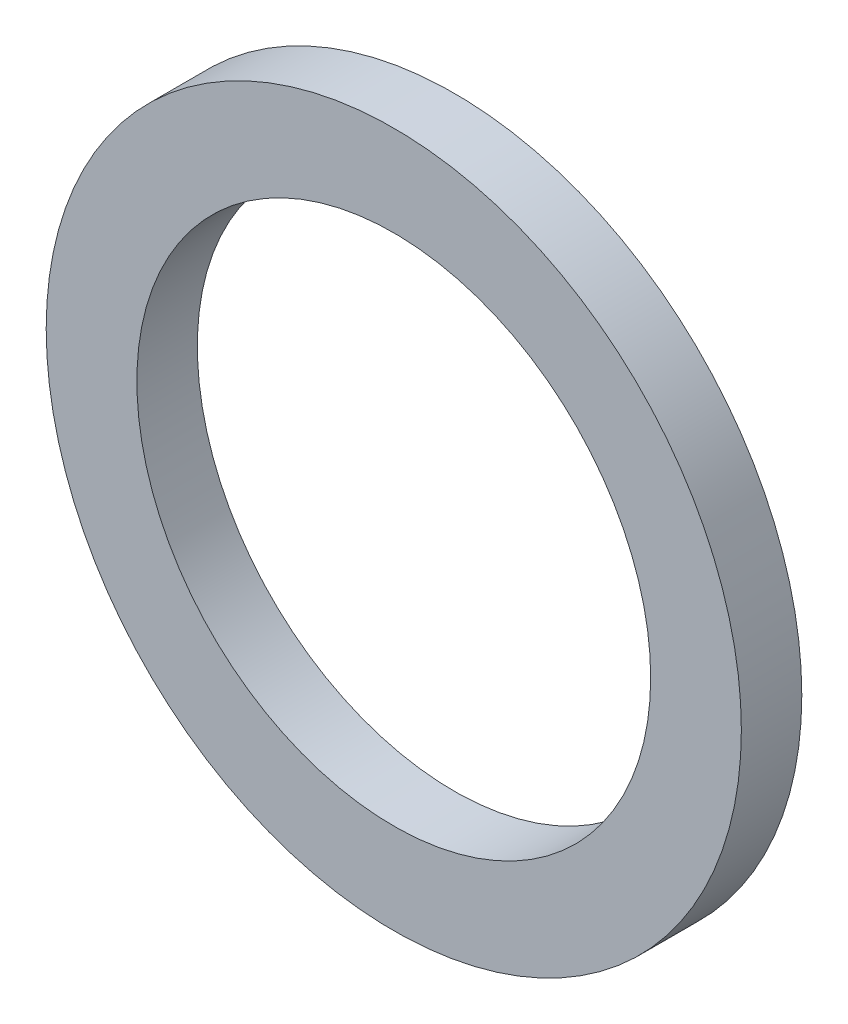
ISO-10303-21;
HEADER;
FILE_DESCRIPTION(('STEP AP214'),'2;1');
FILE_NAME('part.step','',(''),(''),'','','');
FILE_SCHEMA(('AUTOMOTIVE_DESIGN { 1 0 10303 214 1 1 1 1 }'));
ENDSEC;
DATA;
#1=APPLICATION_CONTEXT('core data for automotive mechanical design processes');
#2=APPLICATION_PROTOCOL_DEFINITION('international standard','automotive_design',2000,#1);
#3=PRODUCT_CONTEXT('',#1,'mechanical');
#4=PRODUCT('Part','Part','',(#3));
#5=PRODUCT_RELATED_PRODUCT_CATEGORY('part','',(#4));
#6=PRODUCT_DEFINITION_FORMATION('','',#4);
#7=PRODUCT_DEFINITION_CONTEXT('part definition',#1,'design');
#8=PRODUCT_DEFINITION('design','',#6,#7);
#9=PRODUCT_DEFINITION_SHAPE('','',#8);
#10=(LENGTH_UNIT() NAMED_UNIT(*) SI_UNIT(.MILLI.,.METRE.));
#11=(NAMED_UNIT(*) PLANE_ANGLE_UNIT() SI_UNIT($,.RADIAN.));
#12=(NAMED_UNIT(*) SI_UNIT($,.STERADIAN.) SOLID_ANGLE_UNIT());
#13=UNCERTAINTY_MEASURE_WITH_UNIT(LENGTH_MEASURE(1.E-05),#10,'distance_accuracy_value','');
#14=(GEOMETRIC_REPRESENTATION_CONTEXT(3) GLOBAL_UNCERTAINTY_ASSIGNED_CONTEXT((#13)) GLOBAL_UNIT_ASSIGNED_CONTEXT((#10,
#11,#12)) REPRESENTATION_CONTEXT('',''));
#15=CARTESIAN_POINT('',(0.,0.,0.));
#16=DIRECTION('',(0.,0.,1.));
#17=DIRECTION('',(1.,0.,0.));
#18=AXIS2_PLACEMENT_3D('',#15,#16,#17);
#19=CARTESIAN_POINT('',(0.,0.,-2.));
#20=DIRECTION('',(0.,0.,-1.));
#21=DIRECTION('',(1.,0.,0.));
#22=AXIS2_PLACEMENT_3D('',#19,#20,#21);
#23=PLANE('',#22);
#24=CARTESIAN_POINT('',(0.,0.,-2.));
#25=DIRECTION('',(0.,0.,1.));
#26=DIRECTION('',(1.,0.,0.));
#27=AXIS2_PLACEMENT_3D('',#24,#25,#26);
#28=CIRCLE('',#27,11.5);
#29=CARTESIAN_POINT('',(11.5,0.,-2.));
#30=VERTEX_POINT('',#29);
#31=EDGE_CURVE('E10',#30,#30,#28,.T.);
#32=ORIENTED_EDGE('',*,*,#31,.F.);
#33=EDGE_LOOP('',(#32));
#34=FACE_BOUND('',#33,.T.);
#35=CARTESIAN_POINT('',(0.,0.,-2.));
#36=DIRECTION('',(0.,0.,1.));
#37=DIRECTION('',(1.,0.,0.));
#38=AXIS2_PLACEMENT_3D('',#35,#36,#37);
#39=CIRCLE('',#38,8.5);
#40=CARTESIAN_POINT('',(8.5,0.,-2.));
#41=VERTEX_POINT('',#40);
#42=EDGE_CURVE('E56',#41,#41,#39,.T.);
#43=ORIENTED_EDGE('',*,*,#42,.T.);
#44=EDGE_LOOP('',(#43));
#45=FACE_BOUND('',#44,.T.);
#46=ADVANCED_FACE('F43',(#34,#45),#23,.T.);
#47=CARTESIAN_POINT('',(0.,0.,0.));
#48=DIRECTION('',(0.,0.,-1.));
#49=DIRECTION('',(1.,0.,0.));
#50=AXIS2_PLACEMENT_3D('',#47,#48,#49);
#51=PLANE('',#50);
#52=CARTESIAN_POINT('',(0.,0.,0.));
#53=DIRECTION('',(0.,0.,1.));
#54=DIRECTION('',(1.,0.,0.));
#55=AXIS2_PLACEMENT_3D('',#52,#53,#54);
#56=CIRCLE('',#55,11.5);
#57=CARTESIAN_POINT('',(11.5,0.,0.));
#58=VERTEX_POINT('',#57);
#59=EDGE_CURVE('E47',#58,#58,#56,.T.);
#60=ORIENTED_EDGE('',*,*,#59,.T.);
#61=EDGE_LOOP('',(#60));
#62=FACE_BOUND('',#61,.T.);
#63=CARTESIAN_POINT('',(0.,0.,0.));
#64=DIRECTION('',(0.,0.,1.));
#65=DIRECTION('',(1.,0.,0.));
#66=AXIS2_PLACEMENT_3D('',#63,#64,#65);
#67=CIRCLE('',#66,8.5);
#68=CARTESIAN_POINT('',(8.5,0.,0.));
#69=VERTEX_POINT('',#68);
#70=EDGE_CURVE('E58',#69,#69,#67,.T.);
#71=ORIENTED_EDGE('',*,*,#70,.F.);
#72=EDGE_LOOP('',(#71));
#73=FACE_BOUND('',#72,.T.);
#74=ADVANCED_FACE('F73',(#62,#73),#51,.F.);
#75=CARTESIAN_POINT('',(0.,0.,-2.));
#76=DIRECTION('',(0.,0.,1.));
#77=DIRECTION('',(-1.,0.,0.));
#78=AXIS2_PLACEMENT_3D('',#75,#76,#77);
#79=CYLINDRICAL_SURFACE('',#78,11.5);
#80=ORIENTED_EDGE('',*,*,#31,.T.);
#81=EDGE_LOOP('',(#80));
#82=FACE_BOUND('',#81,.T.);
#83=ORIENTED_EDGE('',*,*,#59,.F.);
#84=EDGE_LOOP('',(#83));
#85=FACE_BOUND('',#84,.T.);
#86=ADVANCED_FACE('F45',(#82,#85),#79,.T.);
#87=CARTESIAN_POINT('',(0.,0.,-2.));
#88=DIRECTION('',(0.,0.,1.));
#89=DIRECTION('',(-1.,0.,0.));
#90=AXIS2_PLACEMENT_3D('',#87,#88,#89);
#91=CYLINDRICAL_SURFACE('',#90,8.5);
#92=ORIENTED_EDGE('',*,*,#42,.F.);
#93=EDGE_LOOP('',(#92));
#94=FACE_BOUND('',#93,.T.);
#95=ORIENTED_EDGE('',*,*,#70,.T.);
#96=EDGE_LOOP('',(#95));
#97=FACE_BOUND('',#96,.T.);
#98=ADVANCED_FACE('F67',(#94,#97),#91,.F.);
#99=CLOSED_SHELL('',(#46,#74,#86,#98));
#100=MANIFOLD_SOLID_BREP('B2',#99);
#101=ADVANCED_BREP_SHAPE_REPRESENTATION('',(#18,#100),#14);
#102=SHAPE_DEFINITION_REPRESENTATION(#9,#101);
ENDSEC;
END-ISO-10303-21;
